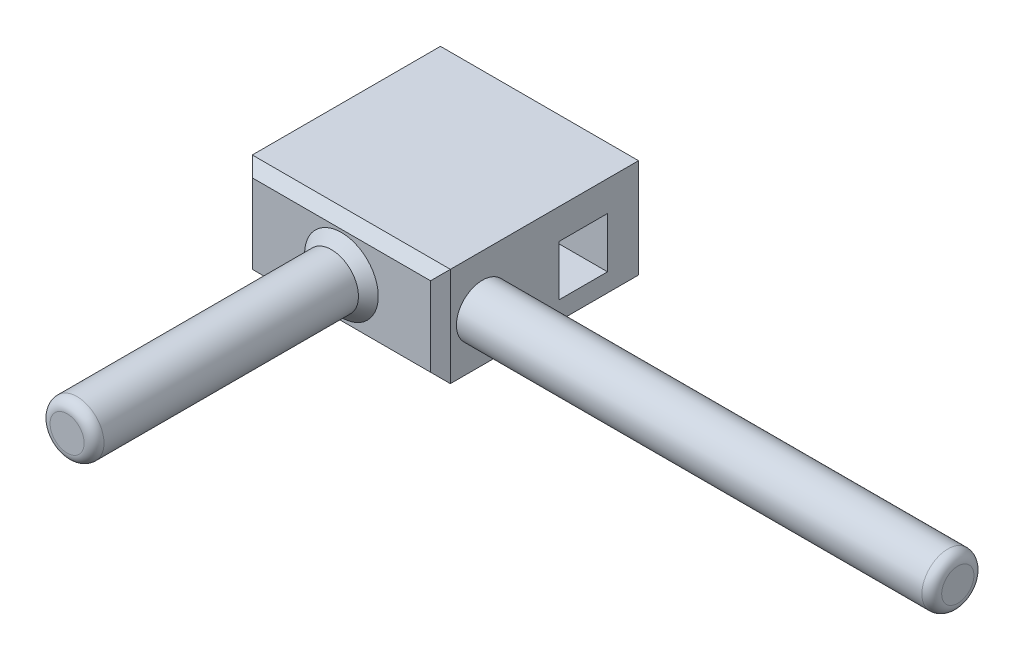
ISO-10303-21;
HEADER;
FILE_DESCRIPTION(('STEP AP214'),'2;1');
FILE_NAME('part.step','',(''),(''),'','','');
FILE_SCHEMA(('AUTOMOTIVE_DESIGN { 1 0 10303 214 1 1 1 1 }'));
ENDSEC;
DATA;
#1=APPLICATION_CONTEXT('core data for automotive mechanical design processes');
#2=APPLICATION_PROTOCOL_DEFINITION('international standard','automotive_design',2000,#1);
#3=PRODUCT_CONTEXT('',#1,'mechanical');
#4=PRODUCT('Part','Part','',(#3));
#5=PRODUCT_RELATED_PRODUCT_CATEGORY('part','',(#4));
#6=PRODUCT_DEFINITION_FORMATION('','',#4);
#7=PRODUCT_DEFINITION_CONTEXT('part definition',#1,'design');
#8=PRODUCT_DEFINITION('design','',#6,#7);
#9=PRODUCT_DEFINITION_SHAPE('','',#8);
#10=(LENGTH_UNIT() NAMED_UNIT(*) SI_UNIT(.MILLI.,.METRE.));
#11=(NAMED_UNIT(*) PLANE_ANGLE_UNIT() SI_UNIT($,.RADIAN.));
#12=(NAMED_UNIT(*) SI_UNIT($,.STERADIAN.) SOLID_ANGLE_UNIT());
#13=UNCERTAINTY_MEASURE_WITH_UNIT(LENGTH_MEASURE(1.E-05),#10,'distance_accuracy_value','');
#14=(GEOMETRIC_REPRESENTATION_CONTEXT(3) GLOBAL_UNCERTAINTY_ASSIGNED_CONTEXT((#13)) GLOBAL_UNIT_ASSIGNED_CONTEXT((#10,
#11,#12)) REPRESENTATION_CONTEXT('',''));
#15=CARTESIAN_POINT('',(0.,0.,0.));
#16=DIRECTION('',(0.,0.,1.));
#17=DIRECTION('',(1.,0.,0.));
#18=AXIS2_PLACEMENT_3D('',#15,#16,#17);
#19=CARTESIAN_POINT('',(0.,0.,-10.));
#20=DIRECTION('',(-1.,0.,0.));
#21=DIRECTION('',(0.,0.,1.));
#22=AXIS2_PLACEMENT_3D('',#19,#20,#21);
#23=PLANE('',#22);
#24=DIRECTION('',(0.,0.,1.));
#25=VECTOR('',#24,1.);
#26=CARTESIAN_POINT('',(0.,0.,-10.));
#27=LINE('',#26,#25);
#28=CARTESIAN_POINT('',(0.,0.,-10.));
#29=VERTEX_POINT('',#28);
#30=CARTESIAN_POINT('',(0.,0.,8.99999999999999));
#31=VERTEX_POINT('',#30);
#32=EDGE_CURVE('E168',#29,#31,#27,.T.);
#33=ORIENTED_EDGE('',*,*,#32,.T.);
#34=DIRECTION('',(0.,1.,0.));
#35=VECTOR('',#34,1.);
#36=CARTESIAN_POINT('',(0.,10.,8.99999999999999));
#37=LINE('',#36,#35);
#38=CARTESIAN_POINT('',(0.,10.,8.99999999999999));
#39=VERTEX_POINT('',#38);
#40=EDGE_CURVE('E200',#31,#39,#37,.T.);
#41=ORIENTED_EDGE('',*,*,#40,.T.);
#42=DIRECTION('',(0.,0.,1.));
#43=VECTOR('',#42,1.);
#44=CARTESIAN_POINT('',(0.,10.,-10.));
#45=LINE('',#44,#43);
#46=CARTESIAN_POINT('',(0.,10.,-10.));
#47=VERTEX_POINT('',#46);
#48=EDGE_CURVE('E169',#47,#39,#45,.T.);
#49=ORIENTED_EDGE('',*,*,#48,.F.);
#50=DIRECTION('',(0.,-1.,0.));
#51=VECTOR('',#50,1.);
#52=CARTESIAN_POINT('',(0.,0.,-10.));
#53=LINE('',#52,#51);
#54=EDGE_CURVE('E156',#47,#29,#53,.T.);
#55=ORIENTED_EDGE('',*,*,#54,.T.);
#56=EDGE_LOOP('',(#33,#41,#49,#55));
#57=FACE_BOUND('',#56,.T.);
#58=DIRECTION('',(0.,0.,1.));
#59=VECTOR('',#58,1.);
#60=CARTESIAN_POINT('',(0.,1.84930894079116,-10.));
#61=LINE('',#60,#59);
#62=CARTESIAN_POINT('',(0.,1.84930894079116,-6.86507011295134));
#63=VERTEX_POINT('',#62);
#64=CARTESIAN_POINT('',(0.,1.84930894079116,-1.98701227543552));
#65=VERTEX_POINT('',#64);
#66=EDGE_CURVE('E148',#63,#65,#61,.T.);
#67=ORIENTED_EDGE('',*,*,#66,.F.);
#68=DIRECTION('',(0.,1.,0.));
#69=VECTOR('',#68,1.);
#70=CARTESIAN_POINT('',(0.,0.,-6.86507011295134));
#71=LINE('',#70,#69);
#72=CARTESIAN_POINT('',(0.,6.94982484930051,-6.86507011295134));
#73=VERTEX_POINT('',#72);
#74=EDGE_CURVE('E150',#63,#73,#71,.T.);
#75=ORIENTED_EDGE('',*,*,#74,.T.);
#76=DIRECTION('',(0.,0.,1.));
#77=VECTOR('',#76,1.);
#78=CARTESIAN_POINT('',(0.,6.94982484930051,-10.));
#79=LINE('',#78,#77);
#80=CARTESIAN_POINT('',(0.,6.94982484930051,-1.98701227543552));
#81=VERTEX_POINT('',#80);
#82=EDGE_CURVE('E143',#73,#81,#79,.T.);
#83=ORIENTED_EDGE('',*,*,#82,.T.);
#84=DIRECTION('',(0.,1.,0.));
#85=VECTOR('',#84,1.);
#86=CARTESIAN_POINT('',(0.,0.,-1.98701227543552));
#87=LINE('',#86,#85);
#88=EDGE_CURVE('E119',#65,#81,#87,.T.);
#89=ORIENTED_EDGE('',*,*,#88,.F.);
#90=EDGE_LOOP('',(#67,#75,#83,#89));
#91=FACE_BOUND('',#90,.T.);
#92=ADVANCED_FACE('F33',(#57,#91),#23,.T.);
#93=CARTESIAN_POINT('',(20.,10.,-10.));
#94=DIRECTION('',(1.,0.,0.));
#95=DIRECTION('',(0.,0.,-1.));
#96=AXIS2_PLACEMENT_3D('',#93,#94,#95);
#97=PLANE('',#96);
#98=CARTESIAN_POINT('',(20.,4.80674107978984,5.76442209654715));
#99=DIRECTION('',(1.,0.,0.));
#100=DIRECTION('',(0.,0.,-1.));
#101=AXIS2_PLACEMENT_3D('',#98,#99,#100);
#102=CIRCLE('',#101,2.62620349279542);
#103=CARTESIAN_POINT('',(20.,4.80674107978984,3.13821860375173));
#104=VERTEX_POINT('',#103);
#105=EDGE_CURVE('E153',#104,#104,#102,.T.);
#106=ORIENTED_EDGE('',*,*,#105,.F.);
#107=EDGE_LOOP('',(#106));
#108=FACE_BOUND('',#107,.T.);
#109=DIRECTION('',(0.,0.,1.));
#110=VECTOR('',#109,1.);
#111=CARTESIAN_POINT('',(20.,10.,-10.));
#112=LINE('',#111,#110);
#113=CARTESIAN_POINT('',(20.,10.,-10.));
#114=VERTEX_POINT('',#113);
#115=CARTESIAN_POINT('',(20.,10.,8.99999999999999));
#116=VERTEX_POINT('',#115);
#117=EDGE_CURVE('E173',#114,#116,#112,.T.);
#118=ORIENTED_EDGE('',*,*,#117,.T.);
#119=DIRECTION('',(0.,-1.,0.));
#120=VECTOR('',#119,1.);
#121=CARTESIAN_POINT('',(20.,0.,8.99999999999999));
#122=LINE('',#121,#120);
#123=CARTESIAN_POINT('',(20.,0.,8.99999999999999));
#124=VERTEX_POINT('',#123);
#125=EDGE_CURVE('E56',#116,#124,#122,.T.);
#126=ORIENTED_EDGE('',*,*,#125,.T.);
#127=DIRECTION('',(0.,0.,1.));
#128=VECTOR('',#127,1.);
#129=CARTESIAN_POINT('',(20.,0.,-10.));
#130=LINE('',#129,#128);
#131=CARTESIAN_POINT('',(20.,0.,-10.));
#132=VERTEX_POINT('',#131);
#133=EDGE_CURVE('E175',#132,#124,#130,.T.);
#134=ORIENTED_EDGE('',*,*,#133,.F.);
#135=DIRECTION('',(0.,1.,0.));
#136=VECTOR('',#135,1.);
#137=CARTESIAN_POINT('',(20.,10.,-10.));
#138=LINE('',#137,#136);
#139=EDGE_CURVE('E162',#132,#114,#138,.T.);
#140=ORIENTED_EDGE('',*,*,#139,.T.);
#141=EDGE_LOOP('',(#118,#126,#134,#140));
#142=FACE_BOUND('',#141,.T.);
#143=DIRECTION('',(0.,0.,-1.));
#144=VECTOR('',#143,1.);
#145=CARTESIAN_POINT('',(20.,6.94982484930051,0.));
#146=LINE('',#145,#144);
#147=CARTESIAN_POINT('',(20.,6.94982484930051,-1.98701227543552));
#148=VERTEX_POINT('',#147);
#149=CARTESIAN_POINT('',(20.,6.94982484930051,-6.86507011295134));
#150=VERTEX_POINT('',#149);
#151=EDGE_CURVE('E127',#148,#150,#146,.T.);
#152=ORIENTED_EDGE('',*,*,#151,.T.);
#153=DIRECTION('',(0.,-1.,0.));
#154=VECTOR('',#153,1.);
#155=CARTESIAN_POINT('',(20.,0.,-6.86507011295134));
#156=LINE('',#155,#154);
#157=CARTESIAN_POINT('',(20.,1.84930894079116,-6.86507011295134));
#158=VERTEX_POINT('',#157);
#159=EDGE_CURVE('E132',#150,#158,#156,.T.);
#160=ORIENTED_EDGE('',*,*,#159,.T.);
#161=DIRECTION('',(0.,0.,-1.));
#162=VECTOR('',#161,1.);
#163=CARTESIAN_POINT('',(20.,1.84930894079116,0.));
#164=LINE('',#163,#162);
#165=CARTESIAN_POINT('',(20.,1.84930894079116,-1.98701227543552));
#166=VERTEX_POINT('',#165);
#167=EDGE_CURVE('E136',#166,#158,#164,.T.);
#168=ORIENTED_EDGE('',*,*,#167,.F.);
#169=DIRECTION('',(0.,-1.,0.));
#170=VECTOR('',#169,1.);
#171=CARTESIAN_POINT('',(20.,0.,-1.98701227543552));
#172=LINE('',#171,#170);
#173=EDGE_CURVE('E116',#148,#166,#172,.T.);
#174=ORIENTED_EDGE('',*,*,#173,.F.);
#175=EDGE_LOOP('',(#152,#160,#168,#174));
#176=FACE_BOUND('',#175,.T.);
#177=ADVANCED_FACE('F134',(#108,#142,#176),#97,.T.);
#178=CARTESIAN_POINT('',(0.,10.,-10.));
#179=DIRECTION('',(0.,1.,0.));
#180=DIRECTION('',(0.,0.,1.));
#181=AXIS2_PLACEMENT_3D('',#178,#179,#180);
#182=PLANE('',#181);
#183=ORIENTED_EDGE('',*,*,#48,.T.);
#184=DIRECTION('',(1.,0.,0.));
#185=VECTOR('',#184,1.);
#186=CARTESIAN_POINT('',(20.,10.,8.99999999999999));
#187=LINE('',#186,#185);
#188=EDGE_CURVE('E195',#39,#116,#187,.T.);
#189=ORIENTED_EDGE('',*,*,#188,.T.);
#190=ORIENTED_EDGE('',*,*,#117,.F.);
#191=DIRECTION('',(-1.,0.,0.));
#192=VECTOR('',#191,1.);
#193=CARTESIAN_POINT('',(0.,10.,-10.));
#194=LINE('',#193,#192);
#195=EDGE_CURVE('E165',#114,#47,#194,.T.);
#196=ORIENTED_EDGE('',*,*,#195,.T.);
#197=EDGE_LOOP('',(#183,#189,#190,#196));
#198=FACE_BOUND('',#197,.T.);
#199=ADVANCED_FACE('F234',(#198),#182,.T.);
#200=CARTESIAN_POINT('',(20.,0.,-10.));
#201=DIRECTION('',(0.,-1.,0.));
#202=DIRECTION('',(0.,0.,-1.));
#203=AXIS2_PLACEMENT_3D('',#200,#201,#202);
#204=PLANE('',#203);
#205=ORIENTED_EDGE('',*,*,#133,.T.);
#206=DIRECTION('',(-1.,0.,0.));
#207=VECTOR('',#206,1.);
#208=CARTESIAN_POINT('',(0.,0.,8.99999999999999));
#209=LINE('',#208,#207);
#210=EDGE_CURVE('E48',#124,#31,#209,.T.);
#211=ORIENTED_EDGE('',*,*,#210,.T.);
#212=ORIENTED_EDGE('',*,*,#32,.F.);
#213=DIRECTION('',(1.,0.,0.));
#214=VECTOR('',#213,1.);
#215=CARTESIAN_POINT('',(20.,0.,-10.));
#216=LINE('',#215,#214);
#217=EDGE_CURVE('E159',#29,#132,#216,.T.);
#218=ORIENTED_EDGE('',*,*,#217,.T.);
#219=EDGE_LOOP('',(#205,#211,#212,#218));
#220=FACE_BOUND('',#219,.T.);
#221=ADVANCED_FACE('F240',(#220),#204,.T.);
#222=CARTESIAN_POINT('',(0.,0.,-10.));
#223=DIRECTION('',(0.,0.,-1.));
#224=DIRECTION('',(-1.,0.,0.));
#225=AXIS2_PLACEMENT_3D('',#222,#223,#224);
#226=PLANE('',#225);
#227=ORIENTED_EDGE('',*,*,#54,.F.);
#228=ORIENTED_EDGE('',*,*,#195,.F.);
#229=ORIENTED_EDGE('',*,*,#139,.F.);
#230=ORIENTED_EDGE('',*,*,#217,.F.);
#231=EDGE_LOOP('',(#227,#228,#229,#230));
#232=FACE_BOUND('',#231,.T.);
#233=ADVANCED_FACE('F279',(#232),#226,.T.);
#234=CARTESIAN_POINT('',(0.,0.,10.));
#235=DIRECTION('',(0.,0.,-1.));
#236=DIRECTION('',(-1.,0.,0.));
#237=AXIS2_PLACEMENT_3D('',#234,#235,#236);
#238=PLANE('',#237);
#239=DIRECTION('',(0.,1.,0.));
#240=VECTOR('',#239,1.);
#241=CARTESIAN_POINT('',(19.,10.,10.));
#242=LINE('',#241,#240);
#243=CARTESIAN_POINT('',(19.,1.00000000000001,10.));
#244=VERTEX_POINT('',#243);
#245=CARTESIAN_POINT('',(19.,8.99999999999999,10.));
#246=VERTEX_POINT('',#245);
#247=EDGE_CURVE('E190',#244,#246,#242,.T.);
#248=ORIENTED_EDGE('',*,*,#247,.T.);
#249=DIRECTION('',(-1.,0.,0.));
#250=VECTOR('',#249,1.);
#251=CARTESIAN_POINT('',(0.,8.99999999999999,10.));
#252=LINE('',#251,#250);
#253=CARTESIAN_POINT('',(1.00000000000001,8.99999999999999,10.));
#254=VERTEX_POINT('',#253);
#255=EDGE_CURVE('E192',#246,#254,#252,.T.);
#256=ORIENTED_EDGE('',*,*,#255,.T.);
#257=DIRECTION('',(0.,-1.,0.));
#258=VECTOR('',#257,1.);
#259=CARTESIAN_POINT('',(1.00000000000001,0.,10.));
#260=LINE('',#259,#258);
#261=CARTESIAN_POINT('',(1.00000000000001,1.00000000000001,10.));
#262=VERTEX_POINT('',#261);
#263=EDGE_CURVE('E186',#254,#262,#260,.T.);
#264=ORIENTED_EDGE('',*,*,#263,.T.);
#265=DIRECTION('',(1.,0.,0.));
#266=VECTOR('',#265,1.);
#267=CARTESIAN_POINT('',(20.,1.00000000000001,10.));
#268=LINE('',#267,#266);
#269=EDGE_CURVE('E188',#262,#244,#268,.T.);
#270=ORIENTED_EDGE('',*,*,#269,.T.);
#271=EDGE_LOOP('',(#248,#256,#264,#270));
#272=FACE_BOUND('',#271,.T.);
#273=CARTESIAN_POINT('',(10.,5.,10.));
#274=DIRECTION('',(0.,0.,-1.));
#275=DIRECTION('',(-1.,0.,0.));
#276=AXIS2_PLACEMENT_3D('',#273,#274,#275);
#277=CIRCLE('',#276,3.72067210223719);
#278=CARTESIAN_POINT('',(6.27932789776281,5.,10.));
#279=VERTEX_POINT('',#278);
#280=EDGE_CURVE('E183',#279,#279,#277,.T.);
#281=ORIENTED_EDGE('',*,*,#280,.T.);
#282=EDGE_LOOP('',(#281));
#283=FACE_BOUND('',#282,.T.);
#284=ADVANCED_FACE('F275',(#272,#283),#238,.F.);
#285=CARTESIAN_POINT('',(10.,5.,37.6954550090451));
#286=DIRECTION('',(0.,0.,-1.));
#287=DIRECTION('',(-1.,0.,0.));
#288=AXIS2_PLACEMENT_3D('',#285,#286,#287);
#289=CYLINDRICAL_SURFACE('',#288,2.72067210223718);
#290=CARTESIAN_POINT('',(10.,5.,11.));
#291=DIRECTION('',(0.,0.,-1.));
#292=DIRECTION('',(-1.,0.,0.));
#293=AXIS2_PLACEMENT_3D('',#290,#291,#292);
#294=CIRCLE('',#293,2.72067210223718);
#295=CARTESIAN_POINT('',(7.27932789776282,5.,11.));
#296=VERTEX_POINT('',#295);
#297=EDGE_CURVE('E202',#296,#296,#294,.F.);
#298=ORIENTED_EDGE('',*,*,#297,.T.);
#299=EDGE_LOOP('',(#298));
#300=FACE_BOUND('',#299,.T.);
#301=CARTESIAN_POINT('',(10.,5.,36.6954550090451));
#302=DIRECTION('',(0.,0.,1.));
#303=DIRECTION('',(1.,0.,0.));
#304=AXIS2_PLACEMENT_3D('',#301,#302,#303);
#305=CIRCLE('',#304,2.72067210223718);
#306=CARTESIAN_POINT('',(12.7206721022372,5.,36.6954550090451));
#307=VERTEX_POINT('',#306);
#308=EDGE_CURVE('E180',#307,#307,#305,.F.);
#309=ORIENTED_EDGE('',*,*,#308,.T.);
#310=EDGE_LOOP('',(#309));
#311=FACE_BOUND('',#310,.T.);
#312=ADVANCED_FACE('F278',(#300,#311),#289,.T.);
#313=CARTESIAN_POINT('',(10.,5.,37.6954550090451));
#314=DIRECTION('',(0.,0.,1.));
#315=DIRECTION('',(1.,0.,0.));
#316=AXIS2_PLACEMENT_3D('',#313,#314,#315);
#317=PLANE('',#316);
#318=CARTESIAN_POINT('',(10.,5.,37.6954550090451));
#319=DIRECTION('',(0.,0.,1.));
#320=DIRECTION('',(1.,0.,0.));
#321=AXIS2_PLACEMENT_3D('',#318,#319,#320);
#322=CIRCLE('',#321,1.72067210223718);
#323=CARTESIAN_POINT('',(11.7206721022372,5.,37.6954550090451));
#324=VERTEX_POINT('',#323);
#325=EDGE_CURVE('E172',#324,#324,#322,.T.);
#326=ORIENTED_EDGE('',*,*,#325,.T.);
#327=EDGE_LOOP('',(#326));
#328=FACE_BOUND('',#327,.T.);
#329=ADVANCED_FACE('F287',(#328),#317,.T.);
#330=CARTESIAN_POINT('',(68.,4.80674107978984,5.76442209654715));
#331=DIRECTION('',(-1.,0.,0.));
#332=DIRECTION('',(0.,0.,1.));
#333=AXIS2_PLACEMENT_3D('',#330,#331,#332);
#334=CYLINDRICAL_SURFACE('',#333,2.62620349279542);
#335=CARTESIAN_POINT('',(67.,4.80674107978984,5.76442209654715));
#336=DIRECTION('',(1.,0.,0.));
#337=DIRECTION('',(0.,0.,-1.));
#338=AXIS2_PLACEMENT_3D('',#335,#336,#337);
#339=CIRCLE('',#338,2.62620349279542);
#340=CARTESIAN_POINT('',(67.,4.80674107978984,3.13821860375173));
#341=VERTEX_POINT('',#340);
#342=EDGE_CURVE('E11',#341,#341,#339,.F.);
#343=ORIENTED_EDGE('',*,*,#342,.T.);
#344=EDGE_LOOP('',(#343));
#345=FACE_BOUND('',#344,.T.);
#346=ORIENTED_EDGE('',*,*,#105,.T.);
#347=EDGE_LOOP('',(#346));
#348=FACE_BOUND('',#347,.T.);
#349=ADVANCED_FACE('F294',(#345,#348),#334,.T.);
#350=CARTESIAN_POINT('',(68.,4.80674107978984,5.76442209654715));
#351=DIRECTION('',(1.,0.,0.));
#352=DIRECTION('',(0.,0.,-1.));
#353=AXIS2_PLACEMENT_3D('',#350,#351,#352);
#354=PLANE('',#353);
#355=CARTESIAN_POINT('',(68.,4.80674107978984,5.76442209654715));
#356=DIRECTION('',(1.,0.,0.));
#357=DIRECTION('',(0.,0.,-1.));
#358=AXIS2_PLACEMENT_3D('',#355,#356,#357);
#359=CIRCLE('',#358,1.62620349279542);
#360=CARTESIAN_POINT('',(68.,4.80674107978984,4.13821860375173));
#361=VERTEX_POINT('',#360);
#362=EDGE_CURVE('E41',#361,#361,#359,.T.);
#363=ORIENTED_EDGE('',*,*,#362,.T.);
#364=EDGE_LOOP('',(#363));
#365=FACE_BOUND('',#364,.T.);
#366=ADVANCED_FACE('F217',(#365),#354,.T.);
#367=CARTESIAN_POINT('',(-28.,0.,-6.86507011295134));
#368=DIRECTION('',(0.,0.,1.));
#369=DIRECTION('',(1.,0.,0.));
#370=AXIS2_PLACEMENT_3D('',#367,#368,#369);
#371=PLANE('',#370);
#372=DIRECTION('',(1.,0.,0.));
#373=VECTOR('',#372,1.);
#374=CARTESIAN_POINT('',(-28.,1.84930894079116,-6.86507011295134));
#375=LINE('',#374,#373);
#376=EDGE_CURVE('E141',#63,#158,#375,.T.);
#377=ORIENTED_EDGE('',*,*,#376,.T.);
#378=ORIENTED_EDGE('',*,*,#159,.F.);
#379=DIRECTION('',(1.,0.,0.));
#380=VECTOR('',#379,1.);
#381=CARTESIAN_POINT('',(-28.,6.94982484930051,-6.86507011295134));
#382=LINE('',#381,#380);
#383=EDGE_CURVE('E123',#73,#150,#382,.T.);
#384=ORIENTED_EDGE('',*,*,#383,.F.);
#385=ORIENTED_EDGE('',*,*,#74,.F.);
#386=EDGE_LOOP('',(#377,#378,#384,#385));
#387=FACE_BOUND('',#386,.T.);
#388=ADVANCED_FACE('F372',(#387),#371,.T.);
#389=CARTESIAN_POINT('',(-28.,1.84930894079116,0.));
#390=DIRECTION('',(0.,-1.,0.));
#391=DIRECTION('',(0.,0.,-1.));
#392=AXIS2_PLACEMENT_3D('',#389,#390,#391);
#393=PLANE('',#392);
#394=ORIENTED_EDGE('',*,*,#66,.T.);
#395=DIRECTION('',(1.,0.,0.));
#396=VECTOR('',#395,1.);
#397=CARTESIAN_POINT('',(-28.,1.84930894079116,-1.98701227543552));
#398=LINE('',#397,#396);
#399=EDGE_CURVE('E122',#65,#166,#398,.T.);
#400=ORIENTED_EDGE('',*,*,#399,.T.);
#401=ORIENTED_EDGE('',*,*,#167,.T.);
#402=ORIENTED_EDGE('',*,*,#376,.F.);
#403=EDGE_LOOP('',(#394,#400,#401,#402));
#404=FACE_BOUND('',#403,.T.);
#405=ADVANCED_FACE('F383',(#404),#393,.F.);
#406=CARTESIAN_POINT('',(-28.,0.,-1.98701227543552));
#407=DIRECTION('',(0.,0.,1.));
#408=DIRECTION('',(1.,0.,0.));
#409=AXIS2_PLACEMENT_3D('',#406,#407,#408);
#410=PLANE('',#409);
#411=ORIENTED_EDGE('',*,*,#88,.T.);
#412=DIRECTION('',(1.,0.,0.));
#413=VECTOR('',#412,1.);
#414=CARTESIAN_POINT('',(-28.,6.94982484930051,-1.98701227543552));
#415=LINE('',#414,#413);
#416=EDGE_CURVE('E111',#81,#148,#415,.T.);
#417=ORIENTED_EDGE('',*,*,#416,.T.);
#418=ORIENTED_EDGE('',*,*,#173,.T.);
#419=ORIENTED_EDGE('',*,*,#399,.F.);
#420=EDGE_LOOP('',(#411,#417,#418,#419));
#421=FACE_BOUND('',#420,.T.);
#422=ADVANCED_FACE('F113',(#421),#410,.F.);
#423=CARTESIAN_POINT('',(-28.,6.94982484930051,0.));
#424=DIRECTION('',(0.,-1.,0.));
#425=DIRECTION('',(0.,0.,-1.));
#426=AXIS2_PLACEMENT_3D('',#423,#424,#425);
#427=PLANE('',#426);
#428=ORIENTED_EDGE('',*,*,#383,.T.);
#429=ORIENTED_EDGE('',*,*,#151,.F.);
#430=ORIENTED_EDGE('',*,*,#416,.F.);
#431=ORIENTED_EDGE('',*,*,#82,.F.);
#432=EDGE_LOOP('',(#428,#429,#430,#431));
#433=FACE_BOUND('',#432,.T.);
#434=ADVANCED_FACE('F128',(#433),#427,.T.);
#435=CARTESIAN_POINT('',(10.,5.,36.6954550090451));
#436=DIRECTION('',(0.,0.,1.));
#437=DIRECTION('',(1.,0.,0.));
#438=AXIS2_PLACEMENT_3D('',#435,#436,#437);
#439=TOROIDAL_SURFACE('',#438,1.72067210223718,1.);
#440=ORIENTED_EDGE('',*,*,#308,.F.);
#441=EDGE_LOOP('',(#440));
#442=FACE_BOUND('',#441,.T.);
#443=ORIENTED_EDGE('',*,*,#325,.F.);
#444=EDGE_LOOP('',(#443));
#445=FACE_BOUND('',#444,.T.);
#446=ADVANCED_FACE('F241',(#442,#445),#439,.T.);
#447=CARTESIAN_POINT('',(0.,1.00000000000001,10.));
#448=DIRECTION('',(0.,-0.707106781186547,0.707106781186547));
#449=DIRECTION('',(-1.,0.,0.));
#450=AXIS2_PLACEMENT_3D('',#447,#448,#449);
#451=PLANE('',#450);
#452=DIRECTION('',(0.577350269189626,0.577350269189626,0.577350269189626));
#453=VECTOR('',#452,1.);
#454=CARTESIAN_POINT('',(0.666666666666672,0.666666666666672,9.66666666666666));
#455=LINE('',#454,#453);
#456=EDGE_CURVE('E209',#31,#262,#455,.T.);
#457=ORIENTED_EDGE('',*,*,#456,.F.);
#458=ORIENTED_EDGE('',*,*,#210,.F.);
#459=DIRECTION('',(-0.577350269189626,0.577350269189626,0.577350269189626));
#460=VECTOR('',#459,1.);
#461=CARTESIAN_POINT('',(12.6666666666667,7.33333333333334,16.3333333333333));
#462=LINE('',#461,#460);
#463=EDGE_CURVE('E212',#244,#124,#462,.F.);
#464=ORIENTED_EDGE('',*,*,#463,.F.);
#465=ORIENTED_EDGE('',*,*,#269,.F.);
#466=EDGE_LOOP('',(#457,#458,#464,#465));
#467=FACE_BOUND('',#466,.T.);
#468=ADVANCED_FACE('F244',(#467),#451,.T.);
#469=CARTESIAN_POINT('',(19.,0.,10.));
#470=DIRECTION('',(0.707106781186547,0.,0.707106781186547));
#471=DIRECTION('',(0.,-1.,0.));
#472=AXIS2_PLACEMENT_3D('',#469,#470,#471);
#473=PLANE('',#472);
#474=ORIENTED_EDGE('',*,*,#463,.T.);
#475=ORIENTED_EDGE('',*,*,#125,.F.);
#476=DIRECTION('',(-0.577350269189626,-0.577350269189626,0.577350269189626));
#477=VECTOR('',#476,1.);
#478=CARTESIAN_POINT('',(16.,5.99999999999999,13.));
#479=LINE('',#478,#477);
#480=EDGE_CURVE('E207',#246,#116,#479,.F.);
#481=ORIENTED_EDGE('',*,*,#480,.F.);
#482=ORIENTED_EDGE('',*,*,#247,.F.);
#483=EDGE_LOOP('',(#474,#475,#481,#482));
#484=FACE_BOUND('',#483,.T.);
#485=ADVANCED_FACE('F252',(#484),#473,.T.);
#486=CARTESIAN_POINT('',(1.00000000000001,0.,10.));
#487=DIRECTION('',(-0.707106781186547,0.,0.707106781186547));
#488=DIRECTION('',(0.,1.,0.));
#489=AXIS2_PLACEMENT_3D('',#486,#487,#488);
#490=PLANE('',#489);
#491=ORIENTED_EDGE('',*,*,#456,.T.);
#492=ORIENTED_EDGE('',*,*,#263,.F.);
#493=DIRECTION('',(-0.577350269189626,0.577350269189626,-0.577350269189626));
#494=VECTOR('',#493,1.);
#495=CARTESIAN_POINT('',(4.00000000000001,5.99999999999999,13.));
#496=LINE('',#495,#494);
#497=EDGE_CURVE('E205',#39,#254,#496,.F.);
#498=ORIENTED_EDGE('',*,*,#497,.F.);
#499=ORIENTED_EDGE('',*,*,#40,.F.);
#500=EDGE_LOOP('',(#491,#492,#498,#499));
#501=FACE_BOUND('',#500,.T.);
#502=ADVANCED_FACE('F248',(#501),#490,.T.);
#503=CARTESIAN_POINT('',(0.,8.99999999999999,10.));
#504=DIRECTION('',(0.,0.707106781186547,0.707106781186547));
#505=DIRECTION('',(1.,0.,0.));
#506=AXIS2_PLACEMENT_3D('',#503,#504,#505);
#507=PLANE('',#506);
#508=ORIENTED_EDGE('',*,*,#480,.T.);
#509=ORIENTED_EDGE('',*,*,#188,.F.);
#510=ORIENTED_EDGE('',*,*,#497,.T.);
#511=ORIENTED_EDGE('',*,*,#255,.F.);
#512=EDGE_LOOP('',(#508,#509,#510,#511));
#513=FACE_BOUND('',#512,.T.);
#514=ADVANCED_FACE('F225',(#513),#507,.T.);
#515=CARTESIAN_POINT('',(10.,5.,11.));
#516=DIRECTION('',(0.,0.,-1.));
#517=DIRECTION('',(-1.,0.,0.));
#518=AXIS2_PLACEMENT_3D('',#515,#516,#517);
#519=CONICAL_SURFACE('',#518,2.72067210223718,0.785398163397442);
#520=ORIENTED_EDGE('',*,*,#280,.F.);
#521=EDGE_LOOP('',(#520));
#522=FACE_BOUND('',#521,.T.);
#523=ORIENTED_EDGE('',*,*,#297,.F.);
#524=EDGE_LOOP('',(#523));
#525=FACE_BOUND('',#524,.T.);
#526=ADVANCED_FACE('F220',(#522,#525),#519,.T.);
#527=CARTESIAN_POINT('',(67.,4.80674107978984,5.76442209654715));
#528=DIRECTION('',(1.,0.,0.));
#529=DIRECTION('',(0.,0.,-1.));
#530=AXIS2_PLACEMENT_3D('',#527,#528,#529);
#531=TOROIDAL_SURFACE('',#530,1.62620349279542,1.);
#532=ORIENTED_EDGE('',*,*,#342,.F.);
#533=EDGE_LOOP('',(#532));
#534=FACE_BOUND('',#533,.T.);
#535=ORIENTED_EDGE('',*,*,#362,.F.);
#536=EDGE_LOOP('',(#535));
#537=FACE_BOUND('',#536,.T.);
#538=ADVANCED_FACE('F35',(#534,#537),#531,.T.);
#539=CLOSED_SHELL('',(#92,#177,#199,#221,#233,#284,#312,#329,#349,#366,#388,#405,#422,#434,#446,
#468,#485,#502,#514,#526,#538));
#540=MANIFOLD_SOLID_BREP('B2',#539);
#541=ADVANCED_BREP_SHAPE_REPRESENTATION('',(#18,#540),#14);
#542=SHAPE_DEFINITION_REPRESENTATION(#9,#541);
ENDSEC;
END-ISO-10303-21;
